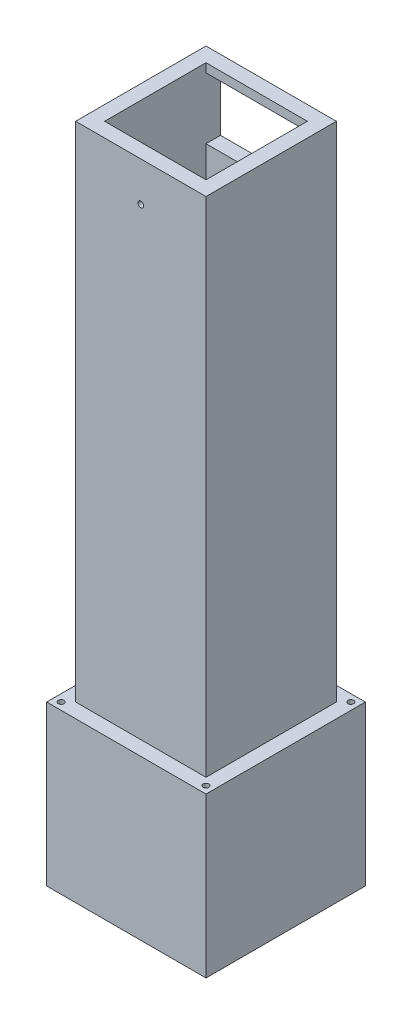
ISO-10303-21;
HEADER;
FILE_DESCRIPTION(('STEP AP214'),'2;1');
FILE_NAME('part.step','',(''),(''),'','','');
FILE_SCHEMA(('AUTOMOTIVE_DESIGN { 1 0 10303 214 1 1 1 1 }'));
ENDSEC;
DATA;
#1=APPLICATION_CONTEXT('core data for automotive mechanical design processes');
#2=APPLICATION_PROTOCOL_DEFINITION('international standard','automotive_design',2000,#1);
#3=PRODUCT_CONTEXT('',#1,'mechanical');
#4=PRODUCT('Part','Part','',(#3));
#5=PRODUCT_RELATED_PRODUCT_CATEGORY('part','',(#4));
#6=PRODUCT_DEFINITION_FORMATION('','',#4);
#7=PRODUCT_DEFINITION_CONTEXT('part definition',#1,'design');
#8=PRODUCT_DEFINITION('design','',#6,#7);
#9=PRODUCT_DEFINITION_SHAPE('','',#8);
#10=(LENGTH_UNIT() NAMED_UNIT(*) SI_UNIT(.MILLI.,.METRE.));
#11=(NAMED_UNIT(*) PLANE_ANGLE_UNIT() SI_UNIT($,.RADIAN.));
#12=(NAMED_UNIT(*) SI_UNIT($,.STERADIAN.) SOLID_ANGLE_UNIT());
#13=UNCERTAINTY_MEASURE_WITH_UNIT(LENGTH_MEASURE(1.E-05),#10,'distance_accuracy_value','');
#14=(GEOMETRIC_REPRESENTATION_CONTEXT(3) GLOBAL_UNCERTAINTY_ASSIGNED_CONTEXT((#13)) GLOBAL_UNIT_ASSIGNED_CONTEXT((#10,
#11,#12)) REPRESENTATION_CONTEXT('',''));
#15=CARTESIAN_POINT('',(0.,0.,0.));
#16=DIRECTION('',(0.,0.,1.));
#17=DIRECTION('',(1.,0.,0.));
#18=AXIS2_PLACEMENT_3D('',#15,#16,#17);
#19=CARTESIAN_POINT('',(-27.5,95.,27.5));
#20=DIRECTION('',(0.,0.,1.));
#21=DIRECTION('',(1.,0.,0.));
#22=AXIS2_PLACEMENT_3D('',#19,#20,#21);
#23=PLANE('',#22);
#24=DIRECTION('',(1.,0.,0.));
#25=VECTOR('',#24,1.);
#26=CARTESIAN_POINT('',(-27.5,100.,27.5));
#27=LINE('',#26,#25);
#28=CARTESIAN_POINT('',(-27.5,100.,27.5));
#29=VERTEX_POINT('',#28);
#30=CARTESIAN_POINT('',(27.5,100.,27.5));
#31=VERTEX_POINT('',#30);
#32=EDGE_CURVE('E253',#29,#31,#27,.T.);
#33=ORIENTED_EDGE('',*,*,#32,.F.);
#34=DIRECTION('',(0.,1.,0.));
#35=VECTOR('',#34,1.);
#36=CARTESIAN_POINT('',(-27.5,95.,27.5));
#37=LINE('',#36,#35);
#38=CARTESIAN_POINT('',(-27.5,45.,27.5));
#39=VERTEX_POINT('',#38);
#40=EDGE_CURVE('E255',#39,#29,#37,.T.);
#41=ORIENTED_EDGE('',*,*,#40,.F.);
#42=DIRECTION('',(-1.,0.,0.));
#43=VECTOR('',#42,1.);
#44=CARTESIAN_POINT('',(-27.5,45.,27.5));
#45=LINE('',#44,#43);
#46=CARTESIAN_POINT('',(27.5,45.,27.5));
#47=VERTEX_POINT('',#46);
#48=EDGE_CURVE('E505',#47,#39,#45,.T.);
#49=ORIENTED_EDGE('',*,*,#48,.F.);
#50=DIRECTION('',(0.,1.,0.));
#51=VECTOR('',#50,1.);
#52=CARTESIAN_POINT('',(27.5,95.,27.5));
#53=LINE('',#52,#51);
#54=EDGE_CURVE('E11',#47,#31,#53,.T.);
#55=ORIENTED_EDGE('',*,*,#54,.T.);
#56=EDGE_LOOP('',(#33,#41,#49,#55));
#57=FACE_BOUND('',#56,.T.);
#58=ADVANCED_FACE('F39',(#57),#23,.T.);
#59=CARTESIAN_POINT('',(27.5,95.,-27.5));
#60=DIRECTION('',(-1.,0.,0.));
#61=DIRECTION('',(0.,0.,1.));
#62=AXIS2_PLACEMENT_3D('',#59,#60,#61);
#63=PLANE('',#62);
#64=DIRECTION('',(0.,0.,1.));
#65=VECTOR('',#64,1.);
#66=CARTESIAN_POINT('',(27.5,100.,-27.5));
#67=LINE('',#66,#65);
#68=CARTESIAN_POINT('',(27.5,100.,-27.5));
#69=VERTEX_POINT('',#68);
#70=EDGE_CURVE('E286',#69,#31,#67,.T.);
#71=ORIENTED_EDGE('',*,*,#70,.T.);
#72=ORIENTED_EDGE('',*,*,#54,.F.);
#73=DIRECTION('',(0.,0.,1.));
#74=VECTOR('',#73,1.);
#75=CARTESIAN_POINT('',(27.5,45.,-27.5));
#76=LINE('',#75,#74);
#77=CARTESIAN_POINT('',(27.5,45.,-27.5));
#78=VERTEX_POINT('',#77);
#79=EDGE_CURVE('E577',#78,#47,#76,.T.);
#80=ORIENTED_EDGE('',*,*,#79,.F.);
#81=DIRECTION('',(0.,1.,0.));
#82=VECTOR('',#81,1.);
#83=CARTESIAN_POINT('',(27.5,95.,-27.5));
#84=LINE('',#83,#82);
#85=EDGE_CURVE('E50',#78,#69,#84,.T.);
#86=ORIENTED_EDGE('',*,*,#85,.T.);
#87=EDGE_LOOP('',(#71,#72,#80,#86));
#88=FACE_BOUND('',#87,.T.);
#89=ADVANCED_FACE('F576',(#88),#63,.F.);
#90=CARTESIAN_POINT('',(-27.5,95.,-27.5));
#91=DIRECTION('',(0.,0.,1.));
#92=DIRECTION('',(1.,0.,0.));
#93=AXIS2_PLACEMENT_3D('',#90,#91,#92);
#94=PLANE('',#93);
#95=DIRECTION('',(1.,0.,0.));
#96=VECTOR('',#95,1.);
#97=CARTESIAN_POINT('',(-27.5,100.,-27.5));
#98=LINE('',#97,#96);
#99=CARTESIAN_POINT('',(-27.5,100.,-27.5));
#100=VERTEX_POINT('',#99);
#101=EDGE_CURVE('E289',#100,#69,#98,.T.);
#102=ORIENTED_EDGE('',*,*,#101,.T.);
#103=ORIENTED_EDGE('',*,*,#85,.F.);
#104=DIRECTION('',(1.,0.,0.));
#105=VECTOR('',#104,1.);
#106=CARTESIAN_POINT('',(-27.5,45.,-27.5));
#107=LINE('',#106,#105);
#108=CARTESIAN_POINT('',(-27.5,45.,-27.5));
#109=VERTEX_POINT('',#108);
#110=EDGE_CURVE('E467',#109,#78,#107,.T.);
#111=ORIENTED_EDGE('',*,*,#110,.F.);
#112=DIRECTION('',(0.,1.,0.));
#113=VECTOR('',#112,1.);
#114=CARTESIAN_POINT('',(-27.5,95.,-27.5));
#115=LINE('',#114,#113);
#116=EDGE_CURVE('E258',#109,#100,#115,.T.);
#117=ORIENTED_EDGE('',*,*,#116,.T.);
#118=EDGE_LOOP('',(#102,#103,#111,#117));
#119=FACE_BOUND('',#118,.T.);
#120=ADVANCED_FACE('F496',(#119),#94,.F.);
#121=CARTESIAN_POINT('',(-27.5,95.,-27.5));
#122=DIRECTION('',(-1.,0.,0.));
#123=DIRECTION('',(0.,0.,1.));
#124=AXIS2_PLACEMENT_3D('',#121,#122,#123);
#125=PLANE('',#124);
#126=DIRECTION('',(0.,0.,1.));
#127=VECTOR('',#126,1.);
#128=CARTESIAN_POINT('',(-27.5,100.,-27.5));
#129=LINE('',#128,#127);
#130=EDGE_CURVE('E250',#100,#29,#129,.T.);
#131=ORIENTED_EDGE('',*,*,#130,.F.);
#132=ORIENTED_EDGE('',*,*,#116,.F.);
#133=DIRECTION('',(0.,0.,-1.));
#134=VECTOR('',#133,1.);
#135=CARTESIAN_POINT('',(-27.5,45.,-27.5));
#136=LINE('',#135,#134);
#137=EDGE_CURVE('E503',#39,#109,#136,.T.);
#138=ORIENTED_EDGE('',*,*,#137,.F.);
#139=ORIENTED_EDGE('',*,*,#40,.T.);
#140=EDGE_LOOP('',(#131,#132,#138,#139));
#141=FACE_BOUND('',#140,.T.);
#142=ADVANCED_FACE('F481',(#141),#125,.T.);
#143=CARTESIAN_POINT('',(0.,100.,0.));
#144=DIRECTION('',(0.,1.,0.));
#145=DIRECTION('',(1.,0.,0.));
#146=AXIS2_PLACEMENT_3D('',#143,#144,#145);
#147=PLANE('',#146);
#148=DIRECTION('',(1.,0.,0.));
#149=VECTOR('',#148,1.);
#150=CARTESIAN_POINT('',(-22.5,100.,22.5));
#151=LINE('',#150,#149);
#152=CARTESIAN_POINT('',(-22.5,100.,22.5));
#153=VERTEX_POINT('',#152);
#154=CARTESIAN_POINT('',(22.5,100.,22.5));
#155=VERTEX_POINT('',#154);
#156=EDGE_CURVE('E430',#153,#155,#151,.T.);
#157=ORIENTED_EDGE('',*,*,#156,.F.);
#158=DIRECTION('',(0.,0.,1.));
#159=VECTOR('',#158,1.);
#160=CARTESIAN_POINT('',(-22.5,100.,22.5));
#161=LINE('',#160,#159);
#162=CARTESIAN_POINT('',(-22.5,100.,-22.5));
#163=VERTEX_POINT('',#162);
#164=EDGE_CURVE('E277',#163,#153,#161,.T.);
#165=ORIENTED_EDGE('',*,*,#164,.F.);
#166=DIRECTION('',(1.,0.,0.));
#167=VECTOR('',#166,1.);
#168=CARTESIAN_POINT('',(-22.5,100.,-22.5));
#169=LINE('',#168,#167);
#170=CARTESIAN_POINT('',(22.5,100.,-22.5));
#171=VERTEX_POINT('',#170);
#172=EDGE_CURVE('E360',#163,#171,#169,.T.);
#173=ORIENTED_EDGE('',*,*,#172,.T.);
#174=DIRECTION('',(0.,0.,1.));
#175=VECTOR('',#174,1.);
#176=CARTESIAN_POINT('',(22.5,100.,22.5));
#177=LINE('',#176,#175);
#178=EDGE_CURVE('E331',#171,#155,#177,.T.);
#179=ORIENTED_EDGE('',*,*,#178,.T.);
#180=EDGE_LOOP('',(#157,#165,#173,#179));
#181=FACE_BOUND('',#180,.T.);
#182=CARTESIAN_POINT('',(25.,100.,25.));
#183=DIRECTION('',(0.,1.,0.));
#184=DIRECTION('',(0.,0.,1.));
#185=AXIS2_PLACEMENT_3D('',#182,#183,#184);
#186=CIRCLE('',#185,1.);
#187=CARTESIAN_POINT('',(25.,100.,24.));
#188=VERTEX_POINT('',#187);
#189=CARTESIAN_POINT('',(25.,100.,26.));
#190=VERTEX_POINT('',#189);
#191=EDGE_CURVE('E394',#188,#190,#186,.T.);
#192=ORIENTED_EDGE('',*,*,#191,.F.);
#193=CARTESIAN_POINT('',(25.,100.,25.));
#194=DIRECTION('',(0.,1.,0.));
#195=DIRECTION('',(0.,0.,1.));
#196=AXIS2_PLACEMENT_3D('',#193,#194,#195);
#197=CIRCLE('',#196,1.);
#198=EDGE_CURVE('E292',#190,#188,#197,.T.);
#199=ORIENTED_EDGE('',*,*,#198,.F.);
#200=EDGE_LOOP('',(#192,#199));
#201=FACE_BOUND('',#200,.T.);
#202=CARTESIAN_POINT('',(-25.,100.,25.));
#203=DIRECTION('',(0.,1.,0.));
#204=DIRECTION('',(0.,0.,1.));
#205=AXIS2_PLACEMENT_3D('',#202,#203,#204);
#206=CIRCLE('',#205,1.);
#207=CARTESIAN_POINT('',(-25.,100.,24.));
#208=VERTEX_POINT('',#207);
#209=CARTESIAN_POINT('',(-25.,100.,26.));
#210=VERTEX_POINT('',#209);
#211=EDGE_CURVE('E382',#208,#210,#206,.T.);
#212=ORIENTED_EDGE('',*,*,#211,.F.);
#213=CARTESIAN_POINT('',(-25.,100.,25.));
#214=DIRECTION('',(0.,1.,0.));
#215=DIRECTION('',(0.,0.,1.));
#216=AXIS2_PLACEMENT_3D('',#213,#214,#215);
#217=CIRCLE('',#216,1.);
#218=EDGE_CURVE('E343',#210,#208,#217,.T.);
#219=ORIENTED_EDGE('',*,*,#218,.F.);
#220=EDGE_LOOP('',(#212,#219));
#221=FACE_BOUND('',#220,.T.);
#222=CARTESIAN_POINT('',(-25.,100.,-25.));
#223=DIRECTION('',(0.,1.,0.));
#224=DIRECTION('',(0.,0.,1.));
#225=AXIS2_PLACEMENT_3D('',#222,#223,#224);
#226=CIRCLE('',#225,1.);
#227=CARTESIAN_POINT('',(-25.,100.,-26.));
#228=VERTEX_POINT('',#227);
#229=CARTESIAN_POINT('',(-25.,100.,-24.));
#230=VERTEX_POINT('',#229);
#231=EDGE_CURVE('E325',#228,#230,#226,.T.);
#232=ORIENTED_EDGE('',*,*,#231,.F.);
#233=CARTESIAN_POINT('',(-25.,100.,-25.));
#234=DIRECTION('',(0.,1.,0.));
#235=DIRECTION('',(0.,0.,1.));
#236=AXIS2_PLACEMENT_3D('',#233,#234,#235);
#237=CIRCLE('',#236,1.);
#238=EDGE_CURVE('E346',#230,#228,#237,.T.);
#239=ORIENTED_EDGE('',*,*,#238,.F.);
#240=EDGE_LOOP('',(#232,#239));
#241=FACE_BOUND('',#240,.T.);
#242=CARTESIAN_POINT('',(25.,100.,-25.));
#243=DIRECTION('',(0.,1.,0.));
#244=DIRECTION('',(0.,0.,1.));
#245=AXIS2_PLACEMENT_3D('',#242,#243,#244);
#246=CIRCLE('',#245,1.);
#247=CARTESIAN_POINT('',(25.,100.,-26.));
#248=VERTEX_POINT('',#247);
#249=CARTESIAN_POINT('',(25.,100.,-24.));
#250=VERTEX_POINT('',#249);
#251=EDGE_CURVE('E375',#248,#250,#246,.T.);
#252=ORIENTED_EDGE('',*,*,#251,.F.);
#253=CARTESIAN_POINT('',(25.,100.,-25.));
#254=DIRECTION('',(0.,1.,0.));
#255=DIRECTION('',(0.,0.,1.));
#256=AXIS2_PLACEMENT_3D('',#253,#254,#255);
#257=CIRCLE('',#256,1.);
#258=EDGE_CURVE('E436',#250,#248,#257,.T.);
#259=ORIENTED_EDGE('',*,*,#258,.F.);
#260=EDGE_LOOP('',(#252,#259));
#261=FACE_BOUND('',#260,.T.);
#262=ORIENTED_EDGE('',*,*,#130,.T.);
#263=ORIENTED_EDGE('',*,*,#32,.T.);
#264=ORIENTED_EDGE('',*,*,#70,.F.);
#265=ORIENTED_EDGE('',*,*,#101,.F.);
#266=EDGE_LOOP('',(#262,#263,#264,#265));
#267=FACE_BOUND('',#266,.T.);
#268=ADVANCED_FACE('F478',(#181,#201,#221,#241,#261,#267),#147,.T.);
#269=CARTESIAN_POINT('',(0.,100.,0.));
#270=DIRECTION('',(0.,1.,0.));
#271=DIRECTION('',(1.,0.,0.));
#272=AXIS2_PLACEMENT_3D('',#269,#270,#271);
#273=PLANE('',#272);
#274=DIRECTION('',(0.,0.,1.));
#275=VECTOR('',#274,1.);
#276=CARTESIAN_POINT('',(17.5,100.,17.5));
#277=LINE('',#276,#275);
#278=CARTESIAN_POINT('',(17.5,100.,-17.5));
#279=VERTEX_POINT('',#278);
#280=CARTESIAN_POINT('',(17.5,100.,17.5));
#281=VERTEX_POINT('',#280);
#282=EDGE_CURVE('E262',#279,#281,#277,.T.);
#283=ORIENTED_EDGE('',*,*,#282,.F.);
#284=DIRECTION('',(-1.,0.,0.));
#285=VECTOR('',#284,1.);
#286=CARTESIAN_POINT('',(-17.5,100.,-17.5));
#287=LINE('',#286,#285);
#288=CARTESIAN_POINT('',(-17.5,100.,-17.5));
#289=VERTEX_POINT('',#288);
#290=EDGE_CURVE('E230',#279,#289,#287,.T.);
#291=ORIENTED_EDGE('',*,*,#290,.T.);
#292=DIRECTION('',(0.,0.,1.));
#293=VECTOR('',#292,1.);
#294=CARTESIAN_POINT('',(-17.5,100.,17.5));
#295=LINE('',#294,#293);
#296=CARTESIAN_POINT('',(-17.5,100.,17.5));
#297=VERTEX_POINT('',#296);
#298=EDGE_CURVE('E221',#289,#297,#295,.T.);
#299=ORIENTED_EDGE('',*,*,#298,.T.);
#300=DIRECTION('',(-1.,0.,0.));
#301=VECTOR('',#300,1.);
#302=CARTESIAN_POINT('',(-17.5,100.,17.5));
#303=LINE('',#302,#301);
#304=EDGE_CURVE('E203',#281,#297,#303,.T.);
#305=ORIENTED_EDGE('',*,*,#304,.F.);
#306=EDGE_LOOP('',(#283,#291,#299,#305));
#307=FACE_BOUND('',#306,.T.);
#308=ADVANCED_FACE('F228',(#307),#273,.T.);
#309=CARTESIAN_POINT('',(-22.5,273.612120728358,-22.5));
#310=DIRECTION('',(0.,-1.,0.));
#311=DIRECTION('',(0.,0.,-1.));
#312=AXIS2_PLACEMENT_3D('',#309,#310,#311);
#313=PLANE('',#312);
#314=DIRECTION('',(1.,0.,0.));
#315=VECTOR('',#314,1.);
#316=CARTESIAN_POINT('',(-17.5,273.612120728358,-17.5));
#317=LINE('',#316,#315);
#318=CARTESIAN_POINT('',(-17.5,273.612120728358,-17.5));
#319=VERTEX_POINT('',#318);
#320=CARTESIAN_POINT('',(17.5,273.612120728358,-17.5));
#321=VERTEX_POINT('',#320);
#322=EDGE_CURVE('E274',#319,#321,#317,.T.);
#323=ORIENTED_EDGE('',*,*,#322,.T.);
#324=DIRECTION('',(0.,0.,-1.));
#325=VECTOR('',#324,1.);
#326=CARTESIAN_POINT('',(17.5,273.612120728358,17.5));
#327=LINE('',#326,#325);
#328=CARTESIAN_POINT('',(17.5,273.612120728358,17.5));
#329=VERTEX_POINT('',#328);
#330=EDGE_CURVE('E269',#329,#321,#327,.T.);
#331=ORIENTED_EDGE('',*,*,#330,.F.);
#332=DIRECTION('',(1.,0.,0.));
#333=VECTOR('',#332,1.);
#334=CARTESIAN_POINT('',(-17.5,273.612120728358,17.5));
#335=LINE('',#334,#333);
#336=CARTESIAN_POINT('',(-17.5,273.612120728358,17.5));
#337=VERTEX_POINT('',#336);
#338=EDGE_CURVE('E215',#337,#329,#335,.T.);
#339=ORIENTED_EDGE('',*,*,#338,.F.);
#340=DIRECTION('',(0.,0.,-1.));
#341=VECTOR('',#340,1.);
#342=CARTESIAN_POINT('',(-17.5,273.612120728358,17.5));
#343=LINE('',#342,#341);
#344=EDGE_CURVE('E224',#337,#319,#343,.T.);
#345=ORIENTED_EDGE('',*,*,#344,.T.);
#346=EDGE_LOOP('',(#323,#331,#339,#345));
#347=FACE_BOUND('',#346,.T.);
#348=DIRECTION('',(1.,0.,0.));
#349=VECTOR('',#348,1.);
#350=CARTESIAN_POINT('',(-22.5,273.612120728358,22.5));
#351=LINE('',#350,#349);
#352=CARTESIAN_POINT('',(-22.5,273.612120728358,22.5));
#353=VERTEX_POINT('',#352);
#354=CARTESIAN_POINT('',(22.5,273.612120728358,22.5));
#355=VERTEX_POINT('',#354);
#356=EDGE_CURVE('E244',#353,#355,#351,.T.);
#357=ORIENTED_EDGE('',*,*,#356,.T.);
#358=DIRECTION('',(0.,0.,1.));
#359=VECTOR('',#358,1.);
#360=CARTESIAN_POINT('',(22.5,273.612120728358,-22.5));
#361=LINE('',#360,#359);
#362=CARTESIAN_POINT('',(22.5,273.612120728358,-22.5));
#363=VERTEX_POINT('',#362);
#364=EDGE_CURVE('E356',#363,#355,#361,.T.);
#365=ORIENTED_EDGE('',*,*,#364,.F.);
#366=DIRECTION('',(1.,0.,0.));
#367=VECTOR('',#366,1.);
#368=CARTESIAN_POINT('',(-22.5,273.612120728358,-22.5));
#369=LINE('',#368,#367);
#370=CARTESIAN_POINT('',(-22.5,273.612120728358,-22.5));
#371=VERTEX_POINT('',#370);
#372=EDGE_CURVE('E304',#371,#363,#369,.T.);
#373=ORIENTED_EDGE('',*,*,#372,.F.);
#374=DIRECTION('',(0.,0.,1.));
#375=VECTOR('',#374,1.);
#376=CARTESIAN_POINT('',(-22.5,273.612120728358,-22.5));
#377=LINE('',#376,#375);
#378=EDGE_CURVE('E340',#371,#353,#377,.T.);
#379=ORIENTED_EDGE('',*,*,#378,.T.);
#380=EDGE_LOOP('',(#357,#365,#373,#379));
#381=FACE_BOUND('',#380,.T.);
#382=ADVANCED_FACE('F41',(#347,#381),#313,.F.);
#383=CARTESIAN_POINT('',(0.,260.,12.5));
#384=DIRECTION('',(0.,0.,1.));
#385=DIRECTION('',(1.,0.,0.));
#386=AXIS2_PLACEMENT_3D('',#383,#384,#385);
#387=CYLINDRICAL_SURFACE('',#386,1.);
#388=DIRECTION('',(0.,0.,1.));
#389=VECTOR('',#388,1.);
#390=CARTESIAN_POINT('',(-1.,260.,12.5));
#391=LINE('',#390,#389);
#392=CARTESIAN_POINT('',(-1.,260.,17.5));
#393=VERTEX_POINT('',#392);
#394=CARTESIAN_POINT('',(-1.,260.,22.5));
#395=VERTEX_POINT('',#394);
#396=EDGE_CURVE('E302',#393,#395,#391,.T.);
#397=ORIENTED_EDGE('',*,*,#396,.F.);
#398=CARTESIAN_POINT('',(0.,260.,17.5));
#399=DIRECTION('',(0.,0.,1.));
#400=DIRECTION('',(1.,0.,0.));
#401=AXIS2_PLACEMENT_3D('',#398,#399,#400);
#402=CIRCLE('',#401,1.);
#403=CARTESIAN_POINT('',(1.,260.,17.5));
#404=VERTEX_POINT('',#403);
#405=EDGE_CURVE('E265',#404,#393,#402,.T.);
#406=ORIENTED_EDGE('',*,*,#405,.F.);
#407=DIRECTION('',(0.,0.,1.));
#408=VECTOR('',#407,1.);
#409=CARTESIAN_POINT('',(1.,260.,12.5));
#410=LINE('',#409,#408);
#411=CARTESIAN_POINT('',(1.,260.,22.5));
#412=VERTEX_POINT('',#411);
#413=EDGE_CURVE('E315',#404,#412,#410,.T.);
#414=ORIENTED_EDGE('',*,*,#413,.T.);
#415=CARTESIAN_POINT('',(0.,260.,22.5));
#416=DIRECTION('',(0.,0.,1.));
#417=DIRECTION('',(1.,0.,0.));
#418=AXIS2_PLACEMENT_3D('',#415,#416,#417);
#419=CIRCLE('',#418,1.);
#420=EDGE_CURVE('E234',#412,#395,#419,.T.);
#421=ORIENTED_EDGE('',*,*,#420,.T.);
#422=EDGE_LOOP('',(#397,#406,#414,#421));
#423=FACE_BOUND('',#422,.T.);
#424=ADVANCED_FACE('F616',(#423),#387,.F.);
#425=CARTESIAN_POINT('',(17.5,270.587205010945,-12.5));
#426=DIRECTION('',(0.,-1.,0.));
#427=DIRECTION('',(0.,0.,-1.));
#428=AXIS2_PLACEMENT_3D('',#425,#426,#427);
#429=PLANE('',#428);
#430=DIRECTION('',(0.,0.,-1.));
#431=VECTOR('',#430,1.);
#432=CARTESIAN_POINT('',(-17.5,270.587205010945,-12.5));
#433=LINE('',#432,#431);
#434=CARTESIAN_POINT('',(-17.5,270.587205010945,-17.5));
#435=VERTEX_POINT('',#434);
#436=CARTESIAN_POINT('',(-17.5,270.587205010945,-22.5));
#437=VERTEX_POINT('',#436);
#438=EDGE_CURVE('E112',#435,#437,#433,.T.);
#439=ORIENTED_EDGE('',*,*,#438,.T.);
#440=DIRECTION('',(-1.,0.,0.));
#441=VECTOR('',#440,1.);
#442=CARTESIAN_POINT('',(17.5,270.587205010945,-22.5));
#443=LINE('',#442,#441);
#444=CARTESIAN_POINT('',(17.5,270.587205010945,-22.5));
#445=VERTEX_POINT('',#444);
#446=EDGE_CURVE('E248',#445,#437,#443,.T.);
#447=ORIENTED_EDGE('',*,*,#446,.F.);
#448=DIRECTION('',(0.,0.,-1.));
#449=VECTOR('',#448,1.);
#450=CARTESIAN_POINT('',(17.5,270.587205010945,-12.5));
#451=LINE('',#450,#449);
#452=CARTESIAN_POINT('',(17.5,270.587205010945,-17.5));
#453=VERTEX_POINT('',#452);
#454=EDGE_CURVE('E266',#453,#445,#451,.T.);
#455=ORIENTED_EDGE('',*,*,#454,.F.);
#456=DIRECTION('',(1.,0.,0.));
#457=VECTOR('',#456,1.);
#458=CARTESIAN_POINT('',(-17.5,270.587205010945,-17.5));
#459=LINE('',#458,#457);
#460=EDGE_CURVE('E273',#435,#453,#459,.T.);
#461=ORIENTED_EDGE('',*,*,#460,.F.);
#462=EDGE_LOOP('',(#439,#447,#455,#461));
#463=FACE_BOUND('',#462,.T.);
#464=ADVANCED_FACE('F612',(#463),#429,.T.);
#465=CARTESIAN_POINT('',(17.5,249.412794989055,-12.5));
#466=DIRECTION('',(0.,-1.,0.));
#467=DIRECTION('',(0.,0.,-1.));
#468=AXIS2_PLACEMENT_3D('',#465,#466,#467);
#469=PLANE('',#468);
#470=DIRECTION('',(1.,0.,0.));
#471=VECTOR('',#470,1.);
#472=CARTESIAN_POINT('',(-17.5,249.412794989055,-17.5));
#473=LINE('',#472,#471);
#474=CARTESIAN_POINT('',(-17.5,249.412794989055,-17.5));
#475=VERTEX_POINT('',#474);
#476=CARTESIAN_POINT('',(17.5,249.412794989055,-17.5));
#477=VERTEX_POINT('',#476);
#478=EDGE_CURVE('E254',#475,#477,#473,.T.);
#479=ORIENTED_EDGE('',*,*,#478,.T.);
#480=DIRECTION('',(0.,0.,-1.));
#481=VECTOR('',#480,1.);
#482=CARTESIAN_POINT('',(17.5,249.412794989055,-12.5));
#483=LINE('',#482,#481);
#484=CARTESIAN_POINT('',(17.5,249.412794989055,-22.5));
#485=VERTEX_POINT('',#484);
#486=EDGE_CURVE('E97',#477,#485,#483,.T.);
#487=ORIENTED_EDGE('',*,*,#486,.T.);
#488=DIRECTION('',(-1.,0.,0.));
#489=VECTOR('',#488,1.);
#490=CARTESIAN_POINT('',(17.5,249.412794989055,-22.5));
#491=LINE('',#490,#489);
#492=CARTESIAN_POINT('',(-17.5,249.412794989055,-22.5));
#493=VERTEX_POINT('',#492);
#494=EDGE_CURVE('E311',#485,#493,#491,.T.);
#495=ORIENTED_EDGE('',*,*,#494,.T.);
#496=DIRECTION('',(0.,0.,-1.));
#497=VECTOR('',#496,1.);
#498=CARTESIAN_POINT('',(-17.5,249.412794989055,-12.5));
#499=LINE('',#498,#497);
#500=EDGE_CURVE('E240',#475,#493,#499,.T.);
#501=ORIENTED_EDGE('',*,*,#500,.F.);
#502=EDGE_LOOP('',(#479,#487,#495,#501));
#503=FACE_BOUND('',#502,.T.);
#504=ADVANCED_FACE('F615',(#503),#469,.F.);
#505=CARTESIAN_POINT('',(-17.5,0.,-17.5));
#506=DIRECTION('',(0.,0.,1.));
#507=DIRECTION('',(1.,0.,0.));
#508=AXIS2_PLACEMENT_3D('',#505,#506,#507);
#509=PLANE('',#508);
#510=ORIENTED_EDGE('',*,*,#290,.F.);
#511=DIRECTION('',(0.,1.,0.));
#512=VECTOR('',#511,1.);
#513=CARTESIAN_POINT('',(17.5,0.,-17.5));
#514=LINE('',#513,#512);
#515=EDGE_CURVE('E226',#279,#477,#514,.T.);
#516=ORIENTED_EDGE('',*,*,#515,.T.);
#517=ORIENTED_EDGE('',*,*,#478,.F.);
#518=DIRECTION('',(0.,1.,0.));
#519=VECTOR('',#518,1.);
#520=CARTESIAN_POINT('',(-17.5,0.,-17.5));
#521=LINE('',#520,#519);
#522=EDGE_CURVE('E233',#289,#475,#521,.T.);
#523=ORIENTED_EDGE('',*,*,#522,.F.);
#524=EDGE_LOOP('',(#510,#516,#517,#523));
#525=FACE_BOUND('',#524,.T.);
#526=ADVANCED_FACE('F647',(#525),#509,.T.);
#527=CARTESIAN_POINT('',(-17.5,0.,17.5));
#528=DIRECTION('',(0.,0.,1.));
#529=DIRECTION('',(1.,0.,0.));
#530=AXIS2_PLACEMENT_3D('',#527,#528,#529);
#531=PLANE('',#530);
#532=ORIENTED_EDGE('',*,*,#405,.T.);
#533=CARTESIAN_POINT('',(0.,260.,17.5));
#534=DIRECTION('',(0.,0.,1.));
#535=DIRECTION('',(1.,0.,0.));
#536=AXIS2_PLACEMENT_3D('',#533,#534,#535);
#537=CIRCLE('',#536,1.);
#538=EDGE_CURVE('E298',#393,#404,#537,.T.);
#539=ORIENTED_EDGE('',*,*,#538,.T.);
#540=EDGE_LOOP('',(#532,#539));
#541=FACE_BOUND('',#540,.T.);
#542=DIRECTION('',(0.,1.,0.));
#543=VECTOR('',#542,1.);
#544=CARTESIAN_POINT('',(17.5,0.,17.5));
#545=LINE('',#544,#543);
#546=EDGE_CURVE('E209',#281,#329,#545,.T.);
#547=ORIENTED_EDGE('',*,*,#546,.F.);
#548=ORIENTED_EDGE('',*,*,#304,.T.);
#549=DIRECTION('',(0.,1.,0.));
#550=VECTOR('',#549,1.);
#551=CARTESIAN_POINT('',(-17.5,0.,17.5));
#552=LINE('',#551,#550);
#553=EDGE_CURVE('E206',#297,#337,#552,.T.);
#554=ORIENTED_EDGE('',*,*,#553,.T.);
#555=ORIENTED_EDGE('',*,*,#338,.T.);
#556=EDGE_LOOP('',(#547,#548,#554,#555));
#557=FACE_BOUND('',#556,.T.);
#558=ADVANCED_FACE('F205',(#541,#557),#531,.F.);
#559=CARTESIAN_POINT('',(17.5,0.,17.5));
#560=DIRECTION('',(1.,0.,0.));
#561=DIRECTION('',(0.,1.,0.));
#562=AXIS2_PLACEMENT_3D('',#559,#560,#561);
#563=PLANE('',#562);
#564=ORIENTED_EDGE('',*,*,#515,.F.);
#565=ORIENTED_EDGE('',*,*,#282,.T.);
#566=ORIENTED_EDGE('',*,*,#546,.T.);
#567=ORIENTED_EDGE('',*,*,#330,.T.);
#568=DIRECTION('',(0.,1.,0.));
#569=VECTOR('',#568,1.);
#570=CARTESIAN_POINT('',(17.5,0.,-17.5));
#571=LINE('',#570,#569);
#572=EDGE_CURVE('E285',#453,#321,#571,.T.);
#573=ORIENTED_EDGE('',*,*,#572,.F.);
#574=ORIENTED_EDGE('',*,*,#454,.T.);
#575=DIRECTION('',(0.,1.,0.));
#576=VECTOR('',#575,1.);
#577=CARTESIAN_POINT('',(17.5,249.412794989055,-22.5));
#578=LINE('',#577,#576);
#579=EDGE_CURVE('E314',#485,#445,#578,.T.);
#580=ORIENTED_EDGE('',*,*,#579,.F.);
#581=ORIENTED_EDGE('',*,*,#486,.F.);
#582=EDGE_LOOP('',(#564,#565,#566,#567,#573,#574,#580,#581));
#583=FACE_BOUND('',#582,.T.);
#584=ADVANCED_FACE('F629',(#583),#563,.F.);
#585=CARTESIAN_POINT('',(-17.5,0.,17.5));
#586=DIRECTION('',(1.,0.,0.));
#587=DIRECTION('',(0.,1.,0.));
#588=AXIS2_PLACEMENT_3D('',#585,#586,#587);
#589=PLANE('',#588);
#590=ORIENTED_EDGE('',*,*,#298,.F.);
#591=ORIENTED_EDGE('',*,*,#522,.T.);
#592=ORIENTED_EDGE('',*,*,#500,.T.);
#593=DIRECTION('',(0.,1.,0.));
#594=VECTOR('',#593,1.);
#595=CARTESIAN_POINT('',(-17.5,249.412794989055,-22.5));
#596=LINE('',#595,#594);
#597=EDGE_CURVE('E306',#493,#437,#596,.T.);
#598=ORIENTED_EDGE('',*,*,#597,.T.);
#599=ORIENTED_EDGE('',*,*,#438,.F.);
#600=DIRECTION('',(0.,1.,0.));
#601=VECTOR('',#600,1.);
#602=CARTESIAN_POINT('',(-17.5,0.,-17.5));
#603=LINE('',#602,#601);
#604=EDGE_CURVE('E270',#435,#319,#603,.T.);
#605=ORIENTED_EDGE('',*,*,#604,.T.);
#606=ORIENTED_EDGE('',*,*,#344,.F.);
#607=ORIENTED_EDGE('',*,*,#553,.F.);
#608=EDGE_LOOP('',(#590,#591,#592,#598,#599,#605,#606,#607));
#609=FACE_BOUND('',#608,.T.);
#610=ADVANCED_FACE('F219',(#609),#589,.T.);
#611=CARTESIAN_POINT('',(-22.5,300.,22.5));
#612=DIRECTION('',(0.,0.,-1.));
#613=DIRECTION('',(0.,-1.,0.));
#614=AXIS2_PLACEMENT_3D('',#611,#612,#613);
#615=PLANE('',#614);
#616=ORIENTED_EDGE('',*,*,#420,.F.);
#617=CARTESIAN_POINT('',(0.,260.,22.5));
#618=DIRECTION('',(0.,0.,1.));
#619=DIRECTION('',(1.,0.,0.));
#620=AXIS2_PLACEMENT_3D('',#617,#618,#619);
#621=CIRCLE('',#620,1.);
#622=EDGE_CURVE('E319',#395,#412,#621,.T.);
#623=ORIENTED_EDGE('',*,*,#622,.F.);
#624=EDGE_LOOP('',(#616,#623));
#625=FACE_BOUND('',#624,.T.);
#626=DIRECTION('',(0.,-1.,0.));
#627=VECTOR('',#626,1.);
#628=CARTESIAN_POINT('',(-22.5,300.,22.5));
#629=LINE('',#628,#627);
#630=EDGE_CURVE('E281',#353,#153,#629,.T.);
#631=ORIENTED_EDGE('',*,*,#630,.T.);
#632=ORIENTED_EDGE('',*,*,#156,.T.);
#633=DIRECTION('',(0.,-1.,0.));
#634=VECTOR('',#633,1.);
#635=CARTESIAN_POINT('',(22.5,300.,22.5));
#636=LINE('',#635,#634);
#637=EDGE_CURVE('E336',#355,#155,#636,.T.);
#638=ORIENTED_EDGE('',*,*,#637,.F.);
#639=ORIENTED_EDGE('',*,*,#356,.F.);
#640=EDGE_LOOP('',(#631,#632,#638,#639));
#641=FACE_BOUND('',#640,.T.);
#642=ADVANCED_FACE('F524',(#625,#641),#615,.F.);
#643=CARTESIAN_POINT('',(-22.5,300.,22.5));
#644=DIRECTION('',(1.,0.,0.));
#645=DIRECTION('',(0.,1.,0.));
#646=AXIS2_PLACEMENT_3D('',#643,#644,#645);
#647=PLANE('',#646);
#648=DIRECTION('',(0.,-1.,0.));
#649=VECTOR('',#648,1.);
#650=CARTESIAN_POINT('',(-22.5,300.,-22.5));
#651=LINE('',#650,#649);
#652=EDGE_CURVE('E307',#371,#163,#651,.T.);
#653=ORIENTED_EDGE('',*,*,#652,.T.);
#654=ORIENTED_EDGE('',*,*,#164,.T.);
#655=ORIENTED_EDGE('',*,*,#630,.F.);
#656=ORIENTED_EDGE('',*,*,#378,.F.);
#657=EDGE_LOOP('',(#653,#654,#655,#656));
#658=FACE_BOUND('',#657,.T.);
#659=ADVANCED_FACE('F623',(#658),#647,.F.);
#660=CARTESIAN_POINT('',(-22.5,300.,-22.5));
#661=DIRECTION('',(0.,0.,1.));
#662=DIRECTION('',(1.,0.,0.));
#663=AXIS2_PLACEMENT_3D('',#660,#661,#662);
#664=PLANE('',#663);
#665=ORIENTED_EDGE('',*,*,#597,.F.);
#666=ORIENTED_EDGE('',*,*,#494,.F.);
#667=ORIENTED_EDGE('',*,*,#579,.T.);
#668=ORIENTED_EDGE('',*,*,#446,.T.);
#669=EDGE_LOOP('',(#665,#666,#667,#668));
#670=FACE_BOUND('',#669,.T.);
#671=DIRECTION('',(0.,-1.,0.));
#672=VECTOR('',#671,1.);
#673=CARTESIAN_POINT('',(22.5,300.,-22.5));
#674=LINE('',#673,#672);
#675=EDGE_CURVE('E335',#363,#171,#674,.T.);
#676=ORIENTED_EDGE('',*,*,#675,.T.);
#677=ORIENTED_EDGE('',*,*,#172,.F.);
#678=ORIENTED_EDGE('',*,*,#652,.F.);
#679=ORIENTED_EDGE('',*,*,#372,.T.);
#680=EDGE_LOOP('',(#676,#677,#678,#679));
#681=FACE_BOUND('',#680,.T.);
#682=ADVANCED_FACE('F626',(#670,#681),#664,.F.);
#683=CARTESIAN_POINT('',(22.5,300.,22.5));
#684=DIRECTION('',(-1.,0.,0.));
#685=DIRECTION('',(0.,0.,1.));
#686=AXIS2_PLACEMENT_3D('',#683,#684,#685);
#687=PLANE('',#686);
#688=ORIENTED_EDGE('',*,*,#637,.T.);
#689=ORIENTED_EDGE('',*,*,#178,.F.);
#690=ORIENTED_EDGE('',*,*,#675,.F.);
#691=ORIENTED_EDGE('',*,*,#364,.T.);
#692=EDGE_LOOP('',(#688,#689,#690,#691));
#693=FACE_BOUND('',#692,.T.);
#694=ADVANCED_FACE('F643',(#693),#687,.F.);
#695=CARTESIAN_POINT('',(-17.5,0.,-17.5));
#696=DIRECTION('',(0.,0.,1.));
#697=DIRECTION('',(1.,0.,0.));
#698=AXIS2_PLACEMENT_3D('',#695,#696,#697);
#699=PLANE('',#698);
#700=ORIENTED_EDGE('',*,*,#322,.F.);
#701=ORIENTED_EDGE('',*,*,#604,.F.);
#702=ORIENTED_EDGE('',*,*,#460,.T.);
#703=ORIENTED_EDGE('',*,*,#572,.T.);
#704=EDGE_LOOP('',(#700,#701,#702,#703));
#705=FACE_BOUND('',#704,.T.);
#706=ADVANCED_FACE('F622',(#705),#699,.T.);
#707=CARTESIAN_POINT('',(0.,260.,12.5));
#708=DIRECTION('',(0.,0.,1.));
#709=DIRECTION('',(1.,0.,0.));
#710=AXIS2_PLACEMENT_3D('',#707,#708,#709);
#711=CYLINDRICAL_SURFACE('',#710,1.);
#712=ORIENTED_EDGE('',*,*,#538,.F.);
#713=ORIENTED_EDGE('',*,*,#396,.T.);
#714=ORIENTED_EDGE('',*,*,#622,.T.);
#715=ORIENTED_EDGE('',*,*,#413,.F.);
#716=EDGE_LOOP('',(#712,#713,#714,#715));
#717=FACE_BOUND('',#716,.T.);
#718=ADVANCED_FACE('F521',(#717),#711,.F.);
#719=CARTESIAN_POINT('',(25.,273.612120728358,25.));
#720=DIRECTION('',(0.,-1.,0.));
#721=DIRECTION('',(0.,0.,-1.));
#722=AXIS2_PLACEMENT_3D('',#719,#720,#721);
#723=CYLINDRICAL_SURFACE('',#722,1.);
#724=ORIENTED_EDGE('',*,*,#191,.T.);
#725=DIRECTION('',(0.,-1.,0.));
#726=VECTOR('',#725,1.);
#727=CARTESIAN_POINT('',(25.,273.612120728358,26.));
#728=LINE('',#727,#726);
#729=CARTESIAN_POINT('',(25.,95.,26.));
#730=VERTEX_POINT('',#729);
#731=EDGE_CURVE('E405',#190,#730,#728,.T.);
#732=ORIENTED_EDGE('',*,*,#731,.T.);
#733=ORIENTED_EDGE('',*,*,#731,.F.);
#734=ORIENTED_EDGE('',*,*,#198,.T.);
#735=DIRECTION('',(0.,-1.,0.));
#736=VECTOR('',#735,1.);
#737=CARTESIAN_POINT('',(25.,273.612120728358,24.));
#738=LINE('',#737,#736);
#739=CARTESIAN_POINT('',(25.,95.,24.));
#740=VERTEX_POINT('',#739);
#741=EDGE_CURVE('E303',#188,#740,#738,.T.);
#742=ORIENTED_EDGE('',*,*,#741,.T.);
#743=ORIENTED_EDGE('',*,*,#741,.F.);
#744=EDGE_LOOP('',(#724,#732,#733,#734,#742,#743));
#745=FACE_BOUND('',#744,.T.);
#746=CARTESIAN_POINT('',(25.,45.,25.));
#747=DIRECTION('',(0.,-1.,0.));
#748=DIRECTION('',(0.,0.,-1.));
#749=AXIS2_PLACEMENT_3D('',#746,#747,#748);
#750=CIRCLE('',#749,0.999999999999998);
#751=CARTESIAN_POINT('',(25.,45.,24.));
#752=VERTEX_POINT('',#751);
#753=EDGE_CURVE('E585',#752,#752,#750,.T.);
#754=ORIENTED_EDGE('',*,*,#753,.T.);
#755=EDGE_LOOP('',(#754));
#756=FACE_BOUND('',#755,.T.);
#757=ADVANCED_FACE('F621',(#745,#756),#723,.F.);
#758=CARTESIAN_POINT('',(-25.,273.612120728358,25.));
#759=DIRECTION('',(0.,-1.,0.));
#760=DIRECTION('',(0.,0.,-1.));
#761=AXIS2_PLACEMENT_3D('',#758,#759,#760);
#762=CYLINDRICAL_SURFACE('',#761,1.);
#763=ORIENTED_EDGE('',*,*,#211,.T.);
#764=DIRECTION('',(0.,-1.,0.));
#765=VECTOR('',#764,1.);
#766=CARTESIAN_POINT('',(-25.,273.612120728358,26.));
#767=LINE('',#766,#765);
#768=CARTESIAN_POINT('',(-25.,95.,26.));
#769=VERTEX_POINT('',#768);
#770=EDGE_CURVE('E395',#210,#769,#767,.T.);
#771=ORIENTED_EDGE('',*,*,#770,.T.);
#772=ORIENTED_EDGE('',*,*,#770,.F.);
#773=ORIENTED_EDGE('',*,*,#218,.T.);
#774=DIRECTION('',(0.,-1.,0.));
#775=VECTOR('',#774,1.);
#776=CARTESIAN_POINT('',(-25.,273.612120728358,24.));
#777=LINE('',#776,#775);
#778=CARTESIAN_POINT('',(-25.,95.,24.));
#779=VERTEX_POINT('',#778);
#780=EDGE_CURVE('E390',#208,#779,#777,.T.);
#781=ORIENTED_EDGE('',*,*,#780,.T.);
#782=ORIENTED_EDGE('',*,*,#780,.F.);
#783=EDGE_LOOP('',(#763,#771,#772,#773,#781,#782));
#784=FACE_BOUND('',#783,.T.);
#785=CARTESIAN_POINT('',(-25.,45.,25.));
#786=DIRECTION('',(0.,-1.,0.));
#787=DIRECTION('',(0.,0.,-1.));
#788=AXIS2_PLACEMENT_3D('',#785,#786,#787);
#789=CIRCLE('',#788,0.999999999999998);
#790=CARTESIAN_POINT('',(-25.,45.,24.));
#791=VERTEX_POINT('',#790);
#792=EDGE_CURVE('E582',#791,#791,#789,.T.);
#793=ORIENTED_EDGE('',*,*,#792,.T.);
#794=EDGE_LOOP('',(#793));
#795=FACE_BOUND('',#794,.T.);
#796=ADVANCED_FACE('F635',(#784,#795),#762,.F.);
#797=CARTESIAN_POINT('',(-25.,273.612120728358,-25.));
#798=DIRECTION('',(0.,-1.,0.));
#799=DIRECTION('',(0.,0.,-1.));
#800=AXIS2_PLACEMENT_3D('',#797,#798,#799);
#801=CYLINDRICAL_SURFACE('',#800,1.);
#802=ORIENTED_EDGE('',*,*,#231,.T.);
#803=DIRECTION('',(0.,-1.,0.));
#804=VECTOR('',#803,1.);
#805=CARTESIAN_POINT('',(-25.,273.612120728358,-24.));
#806=LINE('',#805,#804);
#807=CARTESIAN_POINT('',(-25.,95.,-24.));
#808=VERTEX_POINT('',#807);
#809=EDGE_CURVE('E329',#230,#808,#806,.T.);
#810=ORIENTED_EDGE('',*,*,#809,.T.);
#811=ORIENTED_EDGE('',*,*,#809,.F.);
#812=ORIENTED_EDGE('',*,*,#238,.T.);
#813=DIRECTION('',(0.,-1.,0.));
#814=VECTOR('',#813,1.);
#815=CARTESIAN_POINT('',(-25.,273.612120728358,-26.));
#816=LINE('',#815,#814);
#817=CARTESIAN_POINT('',(-25.,95.,-26.));
#818=VERTEX_POINT('',#817);
#819=EDGE_CURVE('E378',#228,#818,#816,.T.);
#820=ORIENTED_EDGE('',*,*,#819,.T.);
#821=ORIENTED_EDGE('',*,*,#819,.F.);
#822=EDGE_LOOP('',(#802,#810,#811,#812,#820,#821));
#823=FACE_BOUND('',#822,.T.);
#824=CARTESIAN_POINT('',(-25.,45.,-25.));
#825=DIRECTION('',(0.,-1.,0.));
#826=DIRECTION('',(0.,0.,-1.));
#827=AXIS2_PLACEMENT_3D('',#824,#825,#826);
#828=CIRCLE('',#827,0.999999999999998);
#829=CARTESIAN_POINT('',(-25.,45.,-26.));
#830=VERTEX_POINT('',#829);
#831=EDGE_CURVE('E593',#830,#830,#828,.T.);
#832=ORIENTED_EDGE('',*,*,#831,.T.);
#833=EDGE_LOOP('',(#832));
#834=FACE_BOUND('',#833,.T.);
#835=ADVANCED_FACE('F597',(#823,#834),#801,.F.);
#836=CARTESIAN_POINT('',(25.,273.612120728358,-25.));
#837=DIRECTION('',(0.,-1.,0.));
#838=DIRECTION('',(0.,0.,-1.));
#839=AXIS2_PLACEMENT_3D('',#836,#837,#838);
#840=CYLINDRICAL_SURFACE('',#839,1.);
#841=ORIENTED_EDGE('',*,*,#251,.T.);
#842=DIRECTION('',(0.,-1.,0.));
#843=VECTOR('',#842,1.);
#844=CARTESIAN_POINT('',(25.,273.612120728358,-24.));
#845=LINE('',#844,#843);
#846=CARTESIAN_POINT('',(25.,95.,-24.));
#847=VERTEX_POINT('',#846);
#848=EDGE_CURVE('E369',#250,#847,#845,.T.);
#849=ORIENTED_EDGE('',*,*,#848,.T.);
#850=ORIENTED_EDGE('',*,*,#848,.F.);
#851=ORIENTED_EDGE('',*,*,#258,.T.);
#852=DIRECTION('',(0.,-1.,0.));
#853=VECTOR('',#852,1.);
#854=CARTESIAN_POINT('',(25.,273.612120728358,-26.));
#855=LINE('',#854,#853);
#856=CARTESIAN_POINT('',(25.,95.,-26.));
#857=VERTEX_POINT('',#856);
#858=EDGE_CURVE('E330',#248,#857,#855,.T.);
#859=ORIENTED_EDGE('',*,*,#858,.T.);
#860=ORIENTED_EDGE('',*,*,#858,.F.);
#861=EDGE_LOOP('',(#841,#849,#850,#851,#859,#860));
#862=FACE_BOUND('',#861,.T.);
#863=CARTESIAN_POINT('',(25.,45.,-25.));
#864=DIRECTION('',(0.,-1.,0.));
#865=DIRECTION('',(0.,0.,-1.));
#866=AXIS2_PLACEMENT_3D('',#863,#864,#865);
#867=CIRCLE('',#866,1.);
#868=CARTESIAN_POINT('',(25.,45.,-26.));
#869=VERTEX_POINT('',#868);
#870=EDGE_CURVE('E590',#869,#869,#867,.T.);
#871=ORIENTED_EDGE('',*,*,#870,.T.);
#872=EDGE_LOOP('',(#871));
#873=FACE_BOUND('',#872,.T.);
#874=ADVANCED_FACE('F474',(#862,#873),#840,.F.);
#875=CARTESIAN_POINT('',(0.,45.,0.));
#876=DIRECTION('',(0.,1.,0.));
#877=DIRECTION('',(0.,0.,1.));
#878=AXIS2_PLACEMENT_3D('',#875,#876,#877);
#879=PLANE('',#878);
#880=ORIENTED_EDGE('',*,*,#79,.T.);
#881=ORIENTED_EDGE('',*,*,#48,.T.);
#882=ORIENTED_EDGE('',*,*,#137,.T.);
#883=ORIENTED_EDGE('',*,*,#110,.T.);
#884=EDGE_LOOP('',(#880,#881,#882,#883));
#885=FACE_BOUND('',#884,.T.);
#886=ORIENTED_EDGE('',*,*,#792,.F.);
#887=EDGE_LOOP('',(#886));
#888=FACE_BOUND('',#887,.T.);
#889=ORIENTED_EDGE('',*,*,#753,.F.);
#890=EDGE_LOOP('',(#889));
#891=FACE_BOUND('',#890,.T.);
#892=ORIENTED_EDGE('',*,*,#870,.F.);
#893=EDGE_LOOP('',(#892));
#894=FACE_BOUND('',#893,.T.);
#895=ORIENTED_EDGE('',*,*,#831,.F.);
#896=EDGE_LOOP('',(#895));
#897=FACE_BOUND('',#896,.T.);
#898=ADVANCED_FACE('F580',(#885,#888,#891,#894,#897),#879,.F.);
#899=CLOSED_SHELL('',(#58,#89,#120,#142,#268,#308,#382,#424,#464,#504,#526,#558,#584,#610,#642,
#659,#682,#694,#706,#718,#757,#796,#835,#874,#898));
#900=MANIFOLD_SOLID_BREP('B2',#899);
#901=ADVANCED_BREP_SHAPE_REPRESENTATION('',(#18,#900),#14);
#902=SHAPE_DEFINITION_REPRESENTATION(#9,#901);
ENDSEC;
END-ISO-10303-21;
